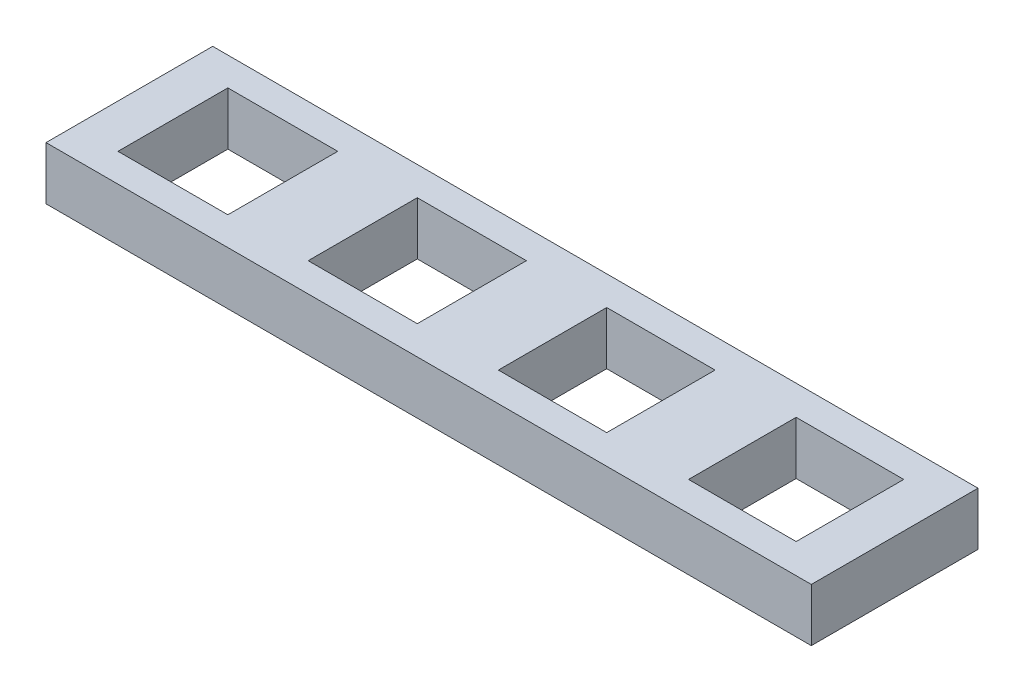
ISO-10303-21;
HEADER;
FILE_DESCRIPTION(('STEP AP214'),'2;1');
FILE_NAME('part.step','',(''),(''),'','','');
FILE_SCHEMA(('AUTOMOTIVE_DESIGN { 1 0 10303 214 1 1 1 1 }'));
ENDSEC;
DATA;
#1=APPLICATION_CONTEXT('core data for automotive mechanical design processes');
#2=APPLICATION_PROTOCOL_DEFINITION('international standard','automotive_design',2000,#1);
#3=PRODUCT_CONTEXT('',#1,'mechanical');
#4=PRODUCT('Part','Part','',(#3));
#5=PRODUCT_RELATED_PRODUCT_CATEGORY('part','',(#4));
#6=PRODUCT_DEFINITION_FORMATION('','',#4);
#7=PRODUCT_DEFINITION_CONTEXT('part definition',#1,'design');
#8=PRODUCT_DEFINITION('design','',#6,#7);
#9=PRODUCT_DEFINITION_SHAPE('','',#8);
#10=(LENGTH_UNIT() NAMED_UNIT(*) SI_UNIT(.MILLI.,.METRE.));
#11=(NAMED_UNIT(*) PLANE_ANGLE_UNIT() SI_UNIT($,.RADIAN.));
#12=(NAMED_UNIT(*) SI_UNIT($,.STERADIAN.) SOLID_ANGLE_UNIT());
#13=UNCERTAINTY_MEASURE_WITH_UNIT(LENGTH_MEASURE(1.E-05),#10,'distance_accuracy_value','');
#14=(GEOMETRIC_REPRESENTATION_CONTEXT(3) GLOBAL_UNCERTAINTY_ASSIGNED_CONTEXT((#13)) GLOBAL_UNIT_ASSIGNED_CONTEXT((#10,
#11,#12)) REPRESENTATION_CONTEXT('',''));
#15=CARTESIAN_POINT('',(0.,0.,0.));
#16=DIRECTION('',(0.,0.,1.));
#17=DIRECTION('',(1.,0.,0.));
#18=AXIS2_PLACEMENT_3D('',#15,#16,#17);
#19=CARTESIAN_POINT('',(0.,7.,0.));
#20=DIRECTION('',(0.,-1.,0.));
#21=DIRECTION('',(0.,0.,-1.));
#22=AXIS2_PLACEMENT_3D('',#19,#20,#21);
#23=PLANE('',#22);
#24=DIRECTION('',(0.,0.,-1.));
#25=VECTOR('',#24,1.);
#26=CARTESIAN_POINT('',(70.15,7.,-3.85000000000001));
#27=LINE('',#26,#25);
#28=CARTESIAN_POINT('',(70.15,7.,-3.85000000000001));
#29=VERTEX_POINT('',#28);
#30=CARTESIAN_POINT('',(70.15,7.,-18.15));
#31=VERTEX_POINT('',#30);
#32=EDGE_CURVE('E212',#29,#31,#27,.T.);
#33=ORIENTED_EDGE('',*,*,#32,.F.);
#34=DIRECTION('',(1.,0.,0.));
#35=VECTOR('',#34,1.);
#36=CARTESIAN_POINT('',(55.85,7.,-3.85000000000001));
#37=LINE('',#36,#35);
#38=CARTESIAN_POINT('',(55.85,7.,-3.85000000000001));
#39=VERTEX_POINT('',#38);
#40=EDGE_CURVE('E220',#39,#29,#37,.T.);
#41=ORIENTED_EDGE('',*,*,#40,.F.);
#42=DIRECTION('',(0.,0.,1.));
#43=VECTOR('',#42,1.);
#44=CARTESIAN_POINT('',(55.85,7.,-3.85000000000001));
#45=LINE('',#44,#43);
#46=CARTESIAN_POINT('',(55.85,7.,-18.15));
#47=VERTEX_POINT('',#46);
#48=EDGE_CURVE('E217',#47,#39,#45,.T.);
#49=ORIENTED_EDGE('',*,*,#48,.F.);
#50=DIRECTION('',(-1.,0.,0.));
#51=VECTOR('',#50,1.);
#52=CARTESIAN_POINT('',(55.85,7.,-18.15));
#53=LINE('',#52,#51);
#54=EDGE_CURVE('E214',#31,#47,#53,.T.);
#55=ORIENTED_EDGE('',*,*,#54,.F.);
#56=EDGE_LOOP('',(#33,#41,#49,#55));
#57=FACE_BOUND('',#56,.T.);
#58=DIRECTION('',(0.,0.,1.));
#59=VECTOR('',#58,1.);
#60=CARTESIAN_POINT('',(5.74999999999999,7.,-18.25));
#61=LINE('',#60,#59);
#62=CARTESIAN_POINT('',(5.74999999999999,7.,-18.25));
#63=VERTEX_POINT('',#62);
#64=CARTESIAN_POINT('',(5.74999999999999,7.,-3.75));
#65=VERTEX_POINT('',#64);
#66=EDGE_CURVE('E274',#63,#65,#61,.T.);
#67=ORIENTED_EDGE('',*,*,#66,.F.);
#68=DIRECTION('',(-1.,0.,0.));
#69=VECTOR('',#68,1.);
#70=CARTESIAN_POINT('',(5.74999999999999,7.,-18.25));
#71=LINE('',#70,#69);
#72=CARTESIAN_POINT('',(20.25,7.,-18.25));
#73=VERTEX_POINT('',#72);
#74=EDGE_CURVE('E282',#73,#63,#71,.T.);
#75=ORIENTED_EDGE('',*,*,#74,.F.);
#76=DIRECTION('',(0.,0.,-1.));
#77=VECTOR('',#76,1.);
#78=CARTESIAN_POINT('',(20.25,7.,-18.25));
#79=LINE('',#78,#77);
#80=CARTESIAN_POINT('',(20.25,7.,-3.74999999999999));
#81=VERTEX_POINT('',#80);
#82=EDGE_CURVE('E279',#81,#73,#79,.T.);
#83=ORIENTED_EDGE('',*,*,#82,.F.);
#84=DIRECTION('',(1.,0.,0.));
#85=VECTOR('',#84,1.);
#86=CARTESIAN_POINT('',(5.74999999999999,7.,-3.75));
#87=LINE('',#86,#85);
#88=EDGE_CURVE('E276',#65,#81,#87,.T.);
#89=ORIENTED_EDGE('',*,*,#88,.F.);
#90=EDGE_LOOP('',(#67,#75,#83,#89));
#91=FACE_BOUND('',#90,.T.);
#92=DIRECTION('',(0.,0.,1.));
#93=VECTOR('',#92,1.);
#94=CARTESIAN_POINT('',(0.,7.,0.));
#95=LINE('',#94,#93);
#96=CARTESIAN_POINT('',(0.,7.,-22.));
#97=VERTEX_POINT('',#96);
#98=CARTESIAN_POINT('',(0.,7.,0.));
#99=VERTEX_POINT('',#98);
#100=EDGE_CURVE('E305',#97,#99,#95,.T.);
#101=ORIENTED_EDGE('',*,*,#100,.T.);
#102=DIRECTION('',(1.,0.,0.));
#103=VECTOR('',#102,1.);
#104=CARTESIAN_POINT('',(0.,7.,0.));
#105=LINE('',#104,#103);
#106=CARTESIAN_POINT('',(101.,7.,0.));
#107=VERTEX_POINT('',#106);
#108=EDGE_CURVE('E308',#99,#107,#105,.T.);
#109=ORIENTED_EDGE('',*,*,#108,.T.);
#110=DIRECTION('',(0.,0.,-1.));
#111=VECTOR('',#110,1.);
#112=CARTESIAN_POINT('',(101.,7.,0.));
#113=LINE('',#112,#111);
#114=CARTESIAN_POINT('',(101.,7.,-22.));
#115=VERTEX_POINT('',#114);
#116=EDGE_CURVE('E311',#107,#115,#113,.T.);
#117=ORIENTED_EDGE('',*,*,#116,.T.);
#118=DIRECTION('',(-1.,0.,0.));
#119=VECTOR('',#118,1.);
#120=CARTESIAN_POINT('',(0.,7.,-22.));
#121=LINE('',#120,#119);
#122=EDGE_CURVE('E313',#115,#97,#121,.T.);
#123=ORIENTED_EDGE('',*,*,#122,.T.);
#124=EDGE_LOOP('',(#101,#109,#117,#123));
#125=FACE_BOUND('',#124,.T.);
#126=DIRECTION('',(0.,0.,-1.));
#127=VECTOR('',#126,1.);
#128=CARTESIAN_POINT('',(45.2,7.,-3.8));
#129=LINE('',#128,#127);
#130=CARTESIAN_POINT('',(45.2,7.,-3.8));
#131=VERTEX_POINT('',#130);
#132=CARTESIAN_POINT('',(45.2,7.,-18.2));
#133=VERTEX_POINT('',#132);
#134=EDGE_CURVE('E243',#131,#133,#129,.T.);
#135=ORIENTED_EDGE('',*,*,#134,.F.);
#136=DIRECTION('',(1.,0.,0.));
#137=VECTOR('',#136,1.);
#138=CARTESIAN_POINT('',(30.8,7.,-3.8));
#139=LINE('',#138,#137);
#140=CARTESIAN_POINT('',(30.8,7.,-3.8));
#141=VERTEX_POINT('',#140);
#142=EDGE_CURVE('E251',#141,#131,#139,.T.);
#143=ORIENTED_EDGE('',*,*,#142,.F.);
#144=DIRECTION('',(0.,0.,1.));
#145=VECTOR('',#144,1.);
#146=CARTESIAN_POINT('',(30.8,7.,-3.8));
#147=LINE('',#146,#145);
#148=CARTESIAN_POINT('',(30.8,7.,-18.2));
#149=VERTEX_POINT('',#148);
#150=EDGE_CURVE('E248',#149,#141,#147,.T.);
#151=ORIENTED_EDGE('',*,*,#150,.F.);
#152=DIRECTION('',(-1.,0.,0.));
#153=VECTOR('',#152,1.);
#154=CARTESIAN_POINT('',(30.8,7.,-18.2));
#155=LINE('',#154,#153);
#156=EDGE_CURVE('E245',#133,#149,#155,.T.);
#157=ORIENTED_EDGE('',*,*,#156,.F.);
#158=EDGE_LOOP('',(#135,#143,#151,#157));
#159=FACE_BOUND('',#158,.T.);
#160=DIRECTION('',(0.,0.,-1.));
#161=VECTOR('',#160,1.);
#162=CARTESIAN_POINT('',(95.1,7.,-3.9));
#163=LINE('',#162,#161);
#164=CARTESIAN_POINT('',(95.1,7.,-3.9));
#165=VERTEX_POINT('',#164);
#166=CARTESIAN_POINT('',(95.1,7.,-18.1));
#167=VERTEX_POINT('',#166);
#168=EDGE_CURVE('E176',#165,#167,#163,.T.);
#169=ORIENTED_EDGE('',*,*,#168,.F.);
#170=DIRECTION('',(1.,0.,0.));
#171=VECTOR('',#170,1.);
#172=CARTESIAN_POINT('',(80.9,7.,-3.9));
#173=LINE('',#172,#171);
#174=CARTESIAN_POINT('',(80.9,7.,-3.9));
#175=VERTEX_POINT('',#174);
#176=EDGE_CURVE('E198',#175,#165,#173,.T.);
#177=ORIENTED_EDGE('',*,*,#176,.F.);
#178=DIRECTION('',(0.,0.,1.));
#179=VECTOR('',#178,1.);
#180=CARTESIAN_POINT('',(80.9,7.,-3.9));
#181=LINE('',#180,#179);
#182=CARTESIAN_POINT('',(80.9,7.,-18.1));
#183=VERTEX_POINT('',#182);
#184=EDGE_CURVE('E196',#183,#175,#181,.T.);
#185=ORIENTED_EDGE('',*,*,#184,.F.);
#186=DIRECTION('',(-1.,0.,0.));
#187=VECTOR('',#186,1.);
#188=CARTESIAN_POINT('',(80.9,7.,-18.1));
#189=LINE('',#188,#187);
#190=EDGE_CURVE('E184',#167,#183,#189,.T.);
#191=ORIENTED_EDGE('',*,*,#190,.F.);
#192=EDGE_LOOP('',(#169,#177,#185,#191));
#193=FACE_BOUND('',#192,.T.);
#194=ADVANCED_FACE('F39',(#57,#91,#125,#159,#193),#23,.F.);
#195=CARTESIAN_POINT('',(0.,0.,0.));
#196=DIRECTION('',(0.,-1.,0.));
#197=DIRECTION('',(0.,0.,-1.));
#198=AXIS2_PLACEMENT_3D('',#195,#196,#197);
#199=PLANE('',#198);
#200=DIRECTION('',(0.,0.,1.));
#201=VECTOR('',#200,1.);
#202=CARTESIAN_POINT('',(0.,0.,0.));
#203=LINE('',#202,#201);
#204=CARTESIAN_POINT('',(0.,0.,-22.));
#205=VERTEX_POINT('',#204);
#206=CARTESIAN_POINT('',(0.,0.,0.));
#207=VERTEX_POINT('',#206);
#208=EDGE_CURVE('E304',#205,#207,#203,.T.);
#209=ORIENTED_EDGE('',*,*,#208,.F.);
#210=DIRECTION('',(-1.,0.,0.));
#211=VECTOR('',#210,1.);
#212=CARTESIAN_POINT('',(0.,0.,-22.));
#213=LINE('',#212,#211);
#214=CARTESIAN_POINT('',(101.,0.,-22.));
#215=VERTEX_POINT('',#214);
#216=EDGE_CURVE('E309',#215,#205,#213,.T.);
#217=ORIENTED_EDGE('',*,*,#216,.F.);
#218=DIRECTION('',(0.,0.,-1.));
#219=VECTOR('',#218,1.);
#220=CARTESIAN_POINT('',(101.,0.,0.));
#221=LINE('',#220,#219);
#222=CARTESIAN_POINT('',(101.,0.,0.));
#223=VERTEX_POINT('',#222);
#224=EDGE_CURVE('E320',#223,#215,#221,.T.);
#225=ORIENTED_EDGE('',*,*,#224,.F.);
#226=DIRECTION('',(1.,0.,0.));
#227=VECTOR('',#226,1.);
#228=CARTESIAN_POINT('',(0.,0.,0.));
#229=LINE('',#228,#227);
#230=EDGE_CURVE('E318',#207,#223,#229,.T.);
#231=ORIENTED_EDGE('',*,*,#230,.F.);
#232=EDGE_LOOP('',(#209,#217,#225,#231));
#233=FACE_BOUND('',#232,.T.);
#234=DIRECTION('',(-1.,0.,0.));
#235=VECTOR('',#234,1.);
#236=CARTESIAN_POINT('',(5.74999999999999,0.,-18.25));
#237=LINE('',#236,#235);
#238=CARTESIAN_POINT('',(20.25,0.,-18.25));
#239=VERTEX_POINT('',#238);
#240=CARTESIAN_POINT('',(5.74999999999999,0.,-18.25));
#241=VERTEX_POINT('',#240);
#242=EDGE_CURVE('E277',#239,#241,#237,.T.);
#243=ORIENTED_EDGE('',*,*,#242,.T.);
#244=DIRECTION('',(0.,0.,1.));
#245=VECTOR('',#244,1.);
#246=CARTESIAN_POINT('',(5.74999999999999,0.,-18.25));
#247=LINE('',#246,#245);
#248=CARTESIAN_POINT('',(5.74999999999999,0.,-3.75));
#249=VERTEX_POINT('',#248);
#250=EDGE_CURVE('E273',#241,#249,#247,.T.);
#251=ORIENTED_EDGE('',*,*,#250,.T.);
#252=DIRECTION('',(1.,0.,0.));
#253=VECTOR('',#252,1.);
#254=CARTESIAN_POINT('',(5.74999999999999,0.,-3.75));
#255=LINE('',#254,#253);
#256=CARTESIAN_POINT('',(20.25,0.,-3.74999999999999));
#257=VERTEX_POINT('',#256);
#258=EDGE_CURVE('E287',#249,#257,#255,.T.);
#259=ORIENTED_EDGE('',*,*,#258,.T.);
#260=DIRECTION('',(0.,0.,-1.));
#261=VECTOR('',#260,1.);
#262=CARTESIAN_POINT('',(20.25,0.,-18.25));
#263=LINE('',#262,#261);
#264=EDGE_CURVE('E290',#257,#239,#263,.T.);
#265=ORIENTED_EDGE('',*,*,#264,.T.);
#266=EDGE_LOOP('',(#243,#251,#259,#265));
#267=FACE_BOUND('',#266,.T.);
#268=DIRECTION('',(1.,0.,0.));
#269=VECTOR('',#268,1.);
#270=CARTESIAN_POINT('',(30.8,0.,-3.8));
#271=LINE('',#270,#269);
#272=CARTESIAN_POINT('',(30.8,0.,-3.8));
#273=VERTEX_POINT('',#272);
#274=CARTESIAN_POINT('',(45.2,0.,-3.8));
#275=VERTEX_POINT('',#274);
#276=EDGE_CURVE('E246',#273,#275,#271,.T.);
#277=ORIENTED_EDGE('',*,*,#276,.T.);
#278=DIRECTION('',(0.,0.,-1.));
#279=VECTOR('',#278,1.);
#280=CARTESIAN_POINT('',(45.2,0.,-3.8));
#281=LINE('',#280,#279);
#282=CARTESIAN_POINT('',(45.2,0.,-18.2));
#283=VERTEX_POINT('',#282);
#284=EDGE_CURVE('E242',#275,#283,#281,.T.);
#285=ORIENTED_EDGE('',*,*,#284,.T.);
#286=DIRECTION('',(-1.,0.,0.));
#287=VECTOR('',#286,1.);
#288=CARTESIAN_POINT('',(30.8,0.,-18.2));
#289=LINE('',#288,#287);
#290=CARTESIAN_POINT('',(30.8,0.,-18.2));
#291=VERTEX_POINT('',#290);
#292=EDGE_CURVE('E256',#283,#291,#289,.T.);
#293=ORIENTED_EDGE('',*,*,#292,.T.);
#294=DIRECTION('',(0.,0.,1.));
#295=VECTOR('',#294,1.);
#296=CARTESIAN_POINT('',(30.8,0.,-3.8));
#297=LINE('',#296,#295);
#298=EDGE_CURVE('E259',#291,#273,#297,.T.);
#299=ORIENTED_EDGE('',*,*,#298,.T.);
#300=EDGE_LOOP('',(#277,#285,#293,#299));
#301=FACE_BOUND('',#300,.T.);
#302=DIRECTION('',(1.,0.,0.));
#303=VECTOR('',#302,1.);
#304=CARTESIAN_POINT('',(55.85,0.,-3.85000000000001));
#305=LINE('',#304,#303);
#306=CARTESIAN_POINT('',(55.85,0.,-3.85000000000001));
#307=VERTEX_POINT('',#306);
#308=CARTESIAN_POINT('',(70.15,0.,-3.85000000000001));
#309=VERTEX_POINT('',#308);
#310=EDGE_CURVE('E215',#307,#309,#305,.T.);
#311=ORIENTED_EDGE('',*,*,#310,.T.);
#312=DIRECTION('',(0.,0.,-1.));
#313=VECTOR('',#312,1.);
#314=CARTESIAN_POINT('',(70.15,0.,-3.85000000000001));
#315=LINE('',#314,#313);
#316=CARTESIAN_POINT('',(70.15,0.,-18.15));
#317=VERTEX_POINT('',#316);
#318=EDGE_CURVE('E192',#309,#317,#315,.T.);
#319=ORIENTED_EDGE('',*,*,#318,.T.);
#320=DIRECTION('',(-1.,0.,0.));
#321=VECTOR('',#320,1.);
#322=CARTESIAN_POINT('',(55.85,0.,-18.15));
#323=LINE('',#322,#321);
#324=CARTESIAN_POINT('',(55.85,0.,-18.15));
#325=VERTEX_POINT('',#324);
#326=EDGE_CURVE('E225',#317,#325,#323,.T.);
#327=ORIENTED_EDGE('',*,*,#326,.T.);
#328=DIRECTION('',(0.,0.,1.));
#329=VECTOR('',#328,1.);
#330=CARTESIAN_POINT('',(55.85,0.,-3.85000000000001));
#331=LINE('',#330,#329);
#332=EDGE_CURVE('E228',#325,#307,#331,.T.);
#333=ORIENTED_EDGE('',*,*,#332,.T.);
#334=EDGE_LOOP('',(#311,#319,#327,#333));
#335=FACE_BOUND('',#334,.T.);
#336=DIRECTION('',(1.,0.,0.));
#337=VECTOR('',#336,1.);
#338=CARTESIAN_POINT('',(80.9,0.,-3.9));
#339=LINE('',#338,#337);
#340=CARTESIAN_POINT('',(80.9,0.,-3.9));
#341=VERTEX_POINT('',#340);
#342=CARTESIAN_POINT('',(95.1,0.,-3.9));
#343=VERTEX_POINT('',#342);
#344=EDGE_CURVE('E185',#341,#343,#339,.T.);
#345=ORIENTED_EDGE('',*,*,#344,.T.);
#346=DIRECTION('',(0.,0.,-1.));
#347=VECTOR('',#346,1.);
#348=CARTESIAN_POINT('',(95.1,0.,-3.9));
#349=LINE('',#348,#347);
#350=CARTESIAN_POINT('',(95.1,0.,-18.1));
#351=VERTEX_POINT('',#350);
#352=EDGE_CURVE('E62',#343,#351,#349,.T.);
#353=ORIENTED_EDGE('',*,*,#352,.T.);
#354=DIRECTION('',(-1.,0.,0.));
#355=VECTOR('',#354,1.);
#356=CARTESIAN_POINT('',(80.9,0.,-18.1));
#357=LINE('',#356,#355);
#358=CARTESIAN_POINT('',(80.9,0.,-18.1));
#359=VERTEX_POINT('',#358);
#360=EDGE_CURVE('E191',#351,#359,#357,.T.);
#361=ORIENTED_EDGE('',*,*,#360,.T.);
#362=DIRECTION('',(0.,0.,1.));
#363=VECTOR('',#362,1.);
#364=CARTESIAN_POINT('',(80.9,0.,-3.9));
#365=LINE('',#364,#363);
#366=EDGE_CURVE('E204',#359,#341,#365,.T.);
#367=ORIENTED_EDGE('',*,*,#366,.T.);
#368=EDGE_LOOP('',(#345,#353,#361,#367));
#369=FACE_BOUND('',#368,.T.);
#370=ADVANCED_FACE('F338',(#233,#267,#301,#335,#369),#199,.T.);
#371=CARTESIAN_POINT('',(0.,7.,0.));
#372=DIRECTION('',(1.,0.,0.));
#373=DIRECTION('',(0.,0.,-1.));
#374=AXIS2_PLACEMENT_3D('',#371,#372,#373);
#375=PLANE('',#374);
#376=ORIENTED_EDGE('',*,*,#208,.T.);
#377=DIRECTION('',(0.,-1.,0.));
#378=VECTOR('',#377,1.);
#379=CARTESIAN_POINT('',(0.,7.,0.));
#380=LINE('',#379,#378);
#381=EDGE_CURVE('E11',#99,#207,#380,.T.);
#382=ORIENTED_EDGE('',*,*,#381,.F.);
#383=ORIENTED_EDGE('',*,*,#100,.F.);
#384=DIRECTION('',(0.,-1.,0.));
#385=VECTOR('',#384,1.);
#386=CARTESIAN_POINT('',(0.,7.,-22.));
#387=LINE('',#386,#385);
#388=EDGE_CURVE('E315',#97,#205,#387,.T.);
#389=ORIENTED_EDGE('',*,*,#388,.T.);
#390=EDGE_LOOP('',(#376,#382,#383,#389));
#391=FACE_BOUND('',#390,.T.);
#392=ADVANCED_FACE('F41',(#391),#375,.F.);
#393=CARTESIAN_POINT('',(0.,7.,0.));
#394=DIRECTION('',(0.,0.,-1.));
#395=DIRECTION('',(-1.,0.,0.));
#396=AXIS2_PLACEMENT_3D('',#393,#394,#395);
#397=PLANE('',#396);
#398=ORIENTED_EDGE('',*,*,#230,.T.);
#399=DIRECTION('',(0.,-1.,0.));
#400=VECTOR('',#399,1.);
#401=CARTESIAN_POINT('',(101.,7.,0.));
#402=LINE('',#401,#400);
#403=EDGE_CURVE('E47',#107,#223,#402,.T.);
#404=ORIENTED_EDGE('',*,*,#403,.F.);
#405=ORIENTED_EDGE('',*,*,#108,.F.);
#406=ORIENTED_EDGE('',*,*,#381,.T.);
#407=EDGE_LOOP('',(#398,#404,#405,#406));
#408=FACE_BOUND('',#407,.T.);
#409=ADVANCED_FACE('F349',(#408),#397,.F.);
#410=CARTESIAN_POINT('',(101.,7.,0.));
#411=DIRECTION('',(-1.,0.,0.));
#412=DIRECTION('',(0.,0.,1.));
#413=AXIS2_PLACEMENT_3D('',#410,#411,#412);
#414=PLANE('',#413);
#415=ORIENTED_EDGE('',*,*,#224,.T.);
#416=DIRECTION('',(0.,-1.,0.));
#417=VECTOR('',#416,1.);
#418=CARTESIAN_POINT('',(101.,7.,-22.));
#419=LINE('',#418,#417);
#420=EDGE_CURVE('E325',#115,#215,#419,.T.);
#421=ORIENTED_EDGE('',*,*,#420,.F.);
#422=ORIENTED_EDGE('',*,*,#116,.F.);
#423=ORIENTED_EDGE('',*,*,#403,.T.);
#424=EDGE_LOOP('',(#415,#421,#422,#423));
#425=FACE_BOUND('',#424,.T.);
#426=ADVANCED_FACE('F332',(#425),#414,.F.);
#427=CARTESIAN_POINT('',(0.,7.,-22.));
#428=DIRECTION('',(0.,0.,1.));
#429=DIRECTION('',(1.,0.,0.));
#430=AXIS2_PLACEMENT_3D('',#427,#428,#429);
#431=PLANE('',#430);
#432=ORIENTED_EDGE('',*,*,#216,.T.);
#433=ORIENTED_EDGE('',*,*,#388,.F.);
#434=ORIENTED_EDGE('',*,*,#122,.F.);
#435=ORIENTED_EDGE('',*,*,#420,.T.);
#436=EDGE_LOOP('',(#432,#433,#434,#435));
#437=FACE_BOUND('',#436,.T.);
#438=ADVANCED_FACE('F342',(#437),#431,.F.);
#439=CARTESIAN_POINT('',(5.74999999999999,7.,-18.25));
#440=DIRECTION('',(1.,0.,0.));
#441=DIRECTION('',(0.,0.,-1.));
#442=AXIS2_PLACEMENT_3D('',#439,#440,#441);
#443=PLANE('',#442);
#444=ORIENTED_EDGE('',*,*,#250,.F.);
#445=DIRECTION('',(0.,-1.,0.));
#446=VECTOR('',#445,1.);
#447=CARTESIAN_POINT('',(5.74999999999999,7.,-18.25));
#448=LINE('',#447,#446);
#449=EDGE_CURVE('E284',#63,#241,#448,.T.);
#450=ORIENTED_EDGE('',*,*,#449,.F.);
#451=ORIENTED_EDGE('',*,*,#66,.T.);
#452=DIRECTION('',(0.,-1.,0.));
#453=VECTOR('',#452,1.);
#454=CARTESIAN_POINT('',(5.74999999999999,7.,-3.75));
#455=LINE('',#454,#453);
#456=EDGE_CURVE('E301',#65,#249,#455,.T.);
#457=ORIENTED_EDGE('',*,*,#456,.T.);
#458=EDGE_LOOP('',(#444,#450,#451,#457));
#459=FACE_BOUND('',#458,.T.);
#460=ADVANCED_FACE('F366',(#459),#443,.T.);
#461=CARTESIAN_POINT('',(5.74999999999999,7.,-3.75));
#462=DIRECTION('',(0.,0.,-1.));
#463=DIRECTION('',(-1.,0.,0.));
#464=AXIS2_PLACEMENT_3D('',#461,#462,#463);
#465=PLANE('',#464);
#466=ORIENTED_EDGE('',*,*,#258,.F.);
#467=ORIENTED_EDGE('',*,*,#456,.F.);
#468=ORIENTED_EDGE('',*,*,#88,.T.);
#469=DIRECTION('',(0.,-1.,0.));
#470=VECTOR('',#469,1.);
#471=CARTESIAN_POINT('',(20.25,7.,-3.74999999999999));
#472=LINE('',#471,#470);
#473=EDGE_CURVE('E299',#81,#257,#472,.T.);
#474=ORIENTED_EDGE('',*,*,#473,.T.);
#475=EDGE_LOOP('',(#466,#467,#468,#474));
#476=FACE_BOUND('',#475,.T.);
#477=ADVANCED_FACE('F373',(#476),#465,.T.);
#478=CARTESIAN_POINT('',(20.25,7.,-18.25));
#479=DIRECTION('',(-1.,0.,0.));
#480=DIRECTION('',(0.,0.,1.));
#481=AXIS2_PLACEMENT_3D('',#478,#479,#480);
#482=PLANE('',#481);
#483=ORIENTED_EDGE('',*,*,#264,.F.);
#484=ORIENTED_EDGE('',*,*,#473,.F.);
#485=ORIENTED_EDGE('',*,*,#82,.T.);
#486=DIRECTION('',(0.,-1.,0.));
#487=VECTOR('',#486,1.);
#488=CARTESIAN_POINT('',(20.25,7.,-18.25));
#489=LINE('',#488,#487);
#490=EDGE_CURVE('E297',#73,#239,#489,.T.);
#491=ORIENTED_EDGE('',*,*,#490,.T.);
#492=EDGE_LOOP('',(#483,#484,#485,#491));
#493=FACE_BOUND('',#492,.T.);
#494=ADVANCED_FACE('F378',(#493),#482,.T.);
#495=CARTESIAN_POINT('',(5.74999999999999,7.,-18.25));
#496=DIRECTION('',(0.,0.,1.));
#497=DIRECTION('',(1.,0.,0.));
#498=AXIS2_PLACEMENT_3D('',#495,#496,#497);
#499=PLANE('',#498);
#500=ORIENTED_EDGE('',*,*,#242,.F.);
#501=ORIENTED_EDGE('',*,*,#490,.F.);
#502=ORIENTED_EDGE('',*,*,#74,.T.);
#503=ORIENTED_EDGE('',*,*,#449,.T.);
#504=EDGE_LOOP('',(#500,#501,#502,#503));
#505=FACE_BOUND('',#504,.T.);
#506=ADVANCED_FACE('F385',(#505),#499,.T.);
#507=CARTESIAN_POINT('',(45.2,7.,-3.8));
#508=DIRECTION('',(-1.,0.,0.));
#509=DIRECTION('',(0.,0.,1.));
#510=AXIS2_PLACEMENT_3D('',#507,#508,#509);
#511=PLANE('',#510);
#512=ORIENTED_EDGE('',*,*,#284,.F.);
#513=DIRECTION('',(0.,-1.,0.));
#514=VECTOR('',#513,1.);
#515=CARTESIAN_POINT('',(45.2,7.,-3.8));
#516=LINE('',#515,#514);
#517=EDGE_CURVE('E253',#131,#275,#516,.T.);
#518=ORIENTED_EDGE('',*,*,#517,.F.);
#519=ORIENTED_EDGE('',*,*,#134,.T.);
#520=DIRECTION('',(0.,-1.,0.));
#521=VECTOR('',#520,1.);
#522=CARTESIAN_POINT('',(45.2,7.,-18.2));
#523=LINE('',#522,#521);
#524=EDGE_CURVE('E270',#133,#283,#523,.T.);
#525=ORIENTED_EDGE('',*,*,#524,.T.);
#526=EDGE_LOOP('',(#512,#518,#519,#525));
#527=FACE_BOUND('',#526,.T.);
#528=ADVANCED_FACE('F398',(#527),#511,.T.);
#529=CARTESIAN_POINT('',(30.8,7.,-18.2));
#530=DIRECTION('',(0.,0.,1.));
#531=DIRECTION('',(1.,0.,0.));
#532=AXIS2_PLACEMENT_3D('',#529,#530,#531);
#533=PLANE('',#532);
#534=ORIENTED_EDGE('',*,*,#292,.F.);
#535=ORIENTED_EDGE('',*,*,#524,.F.);
#536=ORIENTED_EDGE('',*,*,#156,.T.);
#537=DIRECTION('',(0.,-1.,0.));
#538=VECTOR('',#537,1.);
#539=CARTESIAN_POINT('',(30.8,7.,-18.2));
#540=LINE('',#539,#538);
#541=EDGE_CURVE('E268',#149,#291,#540,.T.);
#542=ORIENTED_EDGE('',*,*,#541,.T.);
#543=EDGE_LOOP('',(#534,#535,#536,#542));
#544=FACE_BOUND('',#543,.T.);
#545=ADVANCED_FACE('F403',(#544),#533,.T.);
#546=CARTESIAN_POINT('',(30.8,7.,-3.8));
#547=DIRECTION('',(1.,0.,0.));
#548=DIRECTION('',(0.,0.,-1.));
#549=AXIS2_PLACEMENT_3D('',#546,#547,#548);
#550=PLANE('',#549);
#551=ORIENTED_EDGE('',*,*,#298,.F.);
#552=ORIENTED_EDGE('',*,*,#541,.F.);
#553=ORIENTED_EDGE('',*,*,#150,.T.);
#554=DIRECTION('',(0.,-1.,0.));
#555=VECTOR('',#554,1.);
#556=CARTESIAN_POINT('',(30.8,7.,-3.8));
#557=LINE('',#556,#555);
#558=EDGE_CURVE('E266',#141,#273,#557,.T.);
#559=ORIENTED_EDGE('',*,*,#558,.T.);
#560=EDGE_LOOP('',(#551,#552,#553,#559));
#561=FACE_BOUND('',#560,.T.);
#562=ADVANCED_FACE('F407',(#561),#550,.T.);
#563=CARTESIAN_POINT('',(30.8,7.,-3.8));
#564=DIRECTION('',(0.,0.,-1.));
#565=DIRECTION('',(-1.,0.,0.));
#566=AXIS2_PLACEMENT_3D('',#563,#564,#565);
#567=PLANE('',#566);
#568=ORIENTED_EDGE('',*,*,#276,.F.);
#569=ORIENTED_EDGE('',*,*,#558,.F.);
#570=ORIENTED_EDGE('',*,*,#142,.T.);
#571=ORIENTED_EDGE('',*,*,#517,.T.);
#572=EDGE_LOOP('',(#568,#569,#570,#571));
#573=FACE_BOUND('',#572,.T.);
#574=ADVANCED_FACE('F411',(#573),#567,.T.);
#575=CARTESIAN_POINT('',(70.15,7.,-3.85000000000001));
#576=DIRECTION('',(-1.,0.,0.));
#577=DIRECTION('',(0.,0.,1.));
#578=AXIS2_PLACEMENT_3D('',#575,#576,#577);
#579=PLANE('',#578);
#580=ORIENTED_EDGE('',*,*,#318,.F.);
#581=DIRECTION('',(0.,-1.,0.));
#582=VECTOR('',#581,1.);
#583=CARTESIAN_POINT('',(70.15,7.,-3.85000000000001));
#584=LINE('',#583,#582);
#585=EDGE_CURVE('E222',#29,#309,#584,.T.);
#586=ORIENTED_EDGE('',*,*,#585,.F.);
#587=ORIENTED_EDGE('',*,*,#32,.T.);
#588=DIRECTION('',(0.,-1.,0.));
#589=VECTOR('',#588,1.);
#590=CARTESIAN_POINT('',(70.15,7.,-18.15));
#591=LINE('',#590,#589);
#592=EDGE_CURVE('E239',#31,#317,#591,.T.);
#593=ORIENTED_EDGE('',*,*,#592,.T.);
#594=EDGE_LOOP('',(#580,#586,#587,#593));
#595=FACE_BOUND('',#594,.T.);
#596=ADVANCED_FACE('F415',(#595),#579,.T.);
#597=CARTESIAN_POINT('',(55.85,7.,-18.15));
#598=DIRECTION('',(0.,0.,1.));
#599=DIRECTION('',(1.,0.,0.));
#600=AXIS2_PLACEMENT_3D('',#597,#598,#599);
#601=PLANE('',#600);
#602=ORIENTED_EDGE('',*,*,#326,.F.);
#603=ORIENTED_EDGE('',*,*,#592,.F.);
#604=ORIENTED_EDGE('',*,*,#54,.T.);
#605=DIRECTION('',(0.,-1.,0.));
#606=VECTOR('',#605,1.);
#607=CARTESIAN_POINT('',(55.85,7.,-18.15));
#608=LINE('',#607,#606);
#609=EDGE_CURVE('E237',#47,#325,#608,.T.);
#610=ORIENTED_EDGE('',*,*,#609,.T.);
#611=EDGE_LOOP('',(#602,#603,#604,#610));
#612=FACE_BOUND('',#611,.T.);
#613=ADVANCED_FACE('F419',(#612),#601,.T.);
#614=CARTESIAN_POINT('',(55.85,7.,-3.85000000000001));
#615=DIRECTION('',(1.,0.,0.));
#616=DIRECTION('',(0.,0.,-1.));
#617=AXIS2_PLACEMENT_3D('',#614,#615,#616);
#618=PLANE('',#617);
#619=ORIENTED_EDGE('',*,*,#332,.F.);
#620=ORIENTED_EDGE('',*,*,#609,.F.);
#621=ORIENTED_EDGE('',*,*,#48,.T.);
#622=DIRECTION('',(0.,-1.,0.));
#623=VECTOR('',#622,1.);
#624=CARTESIAN_POINT('',(55.85,7.,-3.85000000000001));
#625=LINE('',#624,#623);
#626=EDGE_CURVE('E235',#39,#307,#625,.T.);
#627=ORIENTED_EDGE('',*,*,#626,.T.);
#628=EDGE_LOOP('',(#619,#620,#621,#627));
#629=FACE_BOUND('',#628,.T.);
#630=ADVANCED_FACE('F423',(#629),#618,.T.);
#631=CARTESIAN_POINT('',(55.85,7.,-3.85000000000001));
#632=DIRECTION('',(0.,0.,-1.));
#633=DIRECTION('',(-1.,0.,0.));
#634=AXIS2_PLACEMENT_3D('',#631,#632,#633);
#635=PLANE('',#634);
#636=ORIENTED_EDGE('',*,*,#310,.F.);
#637=ORIENTED_EDGE('',*,*,#626,.F.);
#638=ORIENTED_EDGE('',*,*,#40,.T.);
#639=ORIENTED_EDGE('',*,*,#585,.T.);
#640=EDGE_LOOP('',(#636,#637,#638,#639));
#641=FACE_BOUND('',#640,.T.);
#642=ADVANCED_FACE('F427',(#641),#635,.T.);
#643=CARTESIAN_POINT('',(95.1,7.,-3.9));
#644=DIRECTION('',(-1.,0.,0.));
#645=DIRECTION('',(0.,0.,1.));
#646=AXIS2_PLACEMENT_3D('',#643,#644,#645);
#647=PLANE('',#646);
#648=ORIENTED_EDGE('',*,*,#352,.F.);
#649=DIRECTION('',(0.,-1.,0.));
#650=VECTOR('',#649,1.);
#651=CARTESIAN_POINT('',(95.1,7.,-3.9));
#652=LINE('',#651,#650);
#653=EDGE_CURVE('E180',#165,#343,#652,.T.);
#654=ORIENTED_EDGE('',*,*,#653,.F.);
#655=ORIENTED_EDGE('',*,*,#168,.T.);
#656=DIRECTION('',(0.,-1.,0.));
#657=VECTOR('',#656,1.);
#658=CARTESIAN_POINT('',(95.1,7.,-18.1));
#659=LINE('',#658,#657);
#660=EDGE_CURVE('E179',#167,#351,#659,.T.);
#661=ORIENTED_EDGE('',*,*,#660,.T.);
#662=EDGE_LOOP('',(#648,#654,#655,#661));
#663=FACE_BOUND('',#662,.T.);
#664=ADVANCED_FACE('F178',(#663),#647,.T.);
#665=CARTESIAN_POINT('',(80.9,7.,-18.1));
#666=DIRECTION('',(0.,0.,1.));
#667=DIRECTION('',(1.,0.,0.));
#668=AXIS2_PLACEMENT_3D('',#665,#666,#667);
#669=PLANE('',#668);
#670=ORIENTED_EDGE('',*,*,#360,.F.);
#671=ORIENTED_EDGE('',*,*,#660,.F.);
#672=ORIENTED_EDGE('',*,*,#190,.T.);
#673=DIRECTION('',(0.,-1.,0.));
#674=VECTOR('',#673,1.);
#675=CARTESIAN_POINT('',(80.9,7.,-18.1));
#676=LINE('',#675,#674);
#677=EDGE_CURVE('E193',#183,#359,#676,.T.);
#678=ORIENTED_EDGE('',*,*,#677,.T.);
#679=EDGE_LOOP('',(#670,#671,#672,#678));
#680=FACE_BOUND('',#679,.T.);
#681=ADVANCED_FACE('F188',(#680),#669,.T.);
#682=CARTESIAN_POINT('',(80.9,7.,-3.9));
#683=DIRECTION('',(1.,0.,0.));
#684=DIRECTION('',(0.,0.,-1.));
#685=AXIS2_PLACEMENT_3D('',#682,#683,#684);
#686=PLANE('',#685);
#687=ORIENTED_EDGE('',*,*,#366,.F.);
#688=ORIENTED_EDGE('',*,*,#677,.F.);
#689=ORIENTED_EDGE('',*,*,#184,.T.);
#690=DIRECTION('',(0.,-1.,0.));
#691=VECTOR('',#690,1.);
#692=CARTESIAN_POINT('',(80.9,7.,-3.9));
#693=LINE('',#692,#691);
#694=EDGE_CURVE('E54',#175,#341,#693,.T.);
#695=ORIENTED_EDGE('',*,*,#694,.T.);
#696=EDGE_LOOP('',(#687,#688,#689,#695));
#697=FACE_BOUND('',#696,.T.);
#698=ADVANCED_FACE('F436',(#697),#686,.T.);
#699=CARTESIAN_POINT('',(80.9,7.,-3.9));
#700=DIRECTION('',(0.,0.,-1.));
#701=DIRECTION('',(-1.,0.,0.));
#702=AXIS2_PLACEMENT_3D('',#699,#700,#701);
#703=PLANE('',#702);
#704=ORIENTED_EDGE('',*,*,#344,.F.);
#705=ORIENTED_EDGE('',*,*,#694,.F.);
#706=ORIENTED_EDGE('',*,*,#176,.T.);
#707=ORIENTED_EDGE('',*,*,#653,.T.);
#708=EDGE_LOOP('',(#704,#705,#706,#707));
#709=FACE_BOUND('',#708,.T.);
#710=ADVANCED_FACE('F439',(#709),#703,.T.);
#711=CLOSED_SHELL('',(#194,#370,#392,#409,#426,#438,#460,#477,#494,#506,#528,#545,#562,#574,
#596,#613,#630,#642,#664,#681,#698,#710));
#712=MANIFOLD_SOLID_BREP('B2',#711);
#713=ADVANCED_BREP_SHAPE_REPRESENTATION('',(#18,#712),#14);
#714=SHAPE_DEFINITION_REPRESENTATION(#9,#713);
ENDSEC;
END-ISO-10303-21;
